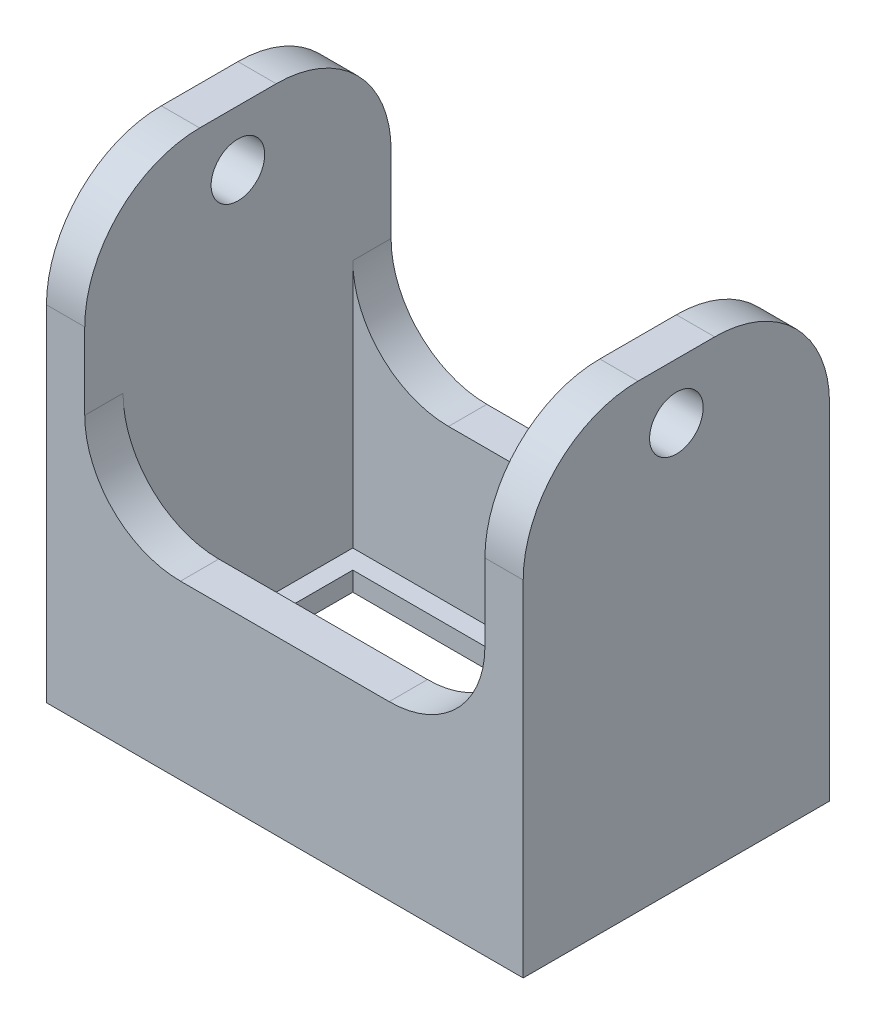
ISO-10303-21;
HEADER;
FILE_DESCRIPTION(('STEP AP214'),'2;1');
FILE_NAME('part.step','',(''),(''),'','','');
FILE_SCHEMA(('AUTOMOTIVE_DESIGN { 1 0 10303 214 1 1 1 1 }'));
ENDSEC;
DATA;
#1=APPLICATION_CONTEXT('core data for automotive mechanical design processes');
#2=APPLICATION_PROTOCOL_DEFINITION('international standard','automotive_design',2000,#1);
#3=PRODUCT_CONTEXT('',#1,'mechanical');
#4=PRODUCT('Part','Part','',(#3));
#5=PRODUCT_RELATED_PRODUCT_CATEGORY('part','',(#4));
#6=PRODUCT_DEFINITION_FORMATION('','',#4);
#7=PRODUCT_DEFINITION_CONTEXT('part definition',#1,'design');
#8=PRODUCT_DEFINITION('design','',#6,#7);
#9=PRODUCT_DEFINITION_SHAPE('','',#8);
#10=(LENGTH_UNIT() NAMED_UNIT(*) SI_UNIT(.MILLI.,.METRE.));
#11=(NAMED_UNIT(*) PLANE_ANGLE_UNIT() SI_UNIT($,.RADIAN.));
#12=(NAMED_UNIT(*) SI_UNIT($,.STERADIAN.) SOLID_ANGLE_UNIT());
#13=UNCERTAINTY_MEASURE_WITH_UNIT(LENGTH_MEASURE(1.E-05),#10,'distance_accuracy_value','');
#14=(GEOMETRIC_REPRESENTATION_CONTEXT(3) GLOBAL_UNCERTAINTY_ASSIGNED_CONTEXT((#13)) GLOBAL_UNIT_ASSIGNED_CONTEXT((#10,
#11,#12)) REPRESENTATION_CONTEXT('',''));
#15=CARTESIAN_POINT('',(0.,0.,0.));
#16=DIRECTION('',(0.,0.,1.));
#17=DIRECTION('',(1.,0.,0.));
#18=AXIS2_PLACEMENT_3D('',#15,#16,#17);
#19=CARTESIAN_POINT('',(0.,9.,0.));
#20=DIRECTION('',(0.,-1.,0.));
#21=DIRECTION('',(0.,0.,-1.));
#22=AXIS2_PLACEMENT_3D('',#19,#20,#21);
#23=PLANE('',#22);
#24=DIRECTION('',(-1.,0.,0.));
#25=VECTOR('',#24,1.);
#26=CARTESIAN_POINT('',(-12.45,9.,-8.));
#27=LINE('',#26,#25);
#28=CARTESIAN_POINT('',(5.45,9.,-8.));
#29=VERTEX_POINT('',#28);
#30=CARTESIAN_POINT('',(-5.45,9.,-8.));
#31=VERTEX_POINT('',#30);
#32=EDGE_CURVE('E217',#29,#31,#27,.T.);
#33=ORIENTED_EDGE('',*,*,#32,.T.);
#34=DIRECTION('',(0.,0.,-1.));
#35=VECTOR('',#34,1.);
#36=CARTESIAN_POINT('',(-5.45,9.,0.));
#37=LINE('',#36,#35);
#38=CARTESIAN_POINT('',(-5.45,9.,-6.));
#39=VERTEX_POINT('',#38);
#40=EDGE_CURVE('E761',#31,#39,#37,.F.);
#41=ORIENTED_EDGE('',*,*,#40,.T.);
#42=DIRECTION('',(-1.,0.,0.));
#43=VECTOR('',#42,1.);
#44=CARTESIAN_POINT('',(10.45,9.,-6.));
#45=LINE('',#44,#43);
#46=CARTESIAN_POINT('',(5.45,9.,-6.));
#47=VERTEX_POINT('',#46);
#48=EDGE_CURVE('E249',#47,#39,#45,.T.);
#49=ORIENTED_EDGE('',*,*,#48,.F.);
#50=DIRECTION('',(0.,0.,1.));
#51=VECTOR('',#50,1.);
#52=CARTESIAN_POINT('',(5.45,9.,0.));
#53=LINE('',#52,#51);
#54=EDGE_CURVE('E253',#47,#29,#53,.F.);
#55=ORIENTED_EDGE('',*,*,#54,.T.);
#56=EDGE_LOOP('',(#33,#41,#49,#55));
#57=FACE_BOUND('',#56,.T.);
#58=ADVANCED_FACE('F35',(#57),#23,.F.);
#59=DIRECTION('',(1.,0.,0.));
#60=VECTOR('',#59,1.);
#61=CARTESIAN_POINT('',(-10.45,9.,6.));
#62=LINE('',#61,#60);
#63=CARTESIAN_POINT('',(-5.45,9.,6.));
#64=VERTEX_POINT('',#63);
#65=CARTESIAN_POINT('',(5.45,9.,6.));
#66=VERTEX_POINT('',#65);
#67=EDGE_CURVE('E233',#64,#66,#62,.T.);
#68=ORIENTED_EDGE('',*,*,#67,.F.);
#69=DIRECTION('',(0.,0.,-1.));
#70=VECTOR('',#69,1.);
#71=CARTESIAN_POINT('',(-5.45,9.,0.));
#72=LINE('',#71,#70);
#73=CARTESIAN_POINT('',(-5.45,9.,8.));
#74=VERTEX_POINT('',#73);
#75=EDGE_CURVE('E247',#64,#74,#72,.F.);
#76=ORIENTED_EDGE('',*,*,#75,.T.);
#77=DIRECTION('',(1.,0.,0.));
#78=VECTOR('',#77,1.);
#79=CARTESIAN_POINT('',(-12.45,9.,8.));
#80=LINE('',#79,#78);
#81=CARTESIAN_POINT('',(5.45,9.,8.));
#82=VERTEX_POINT('',#81);
#83=EDGE_CURVE('E246',#74,#82,#80,.T.);
#84=ORIENTED_EDGE('',*,*,#83,.T.);
#85=DIRECTION('',(0.,0.,1.));
#86=VECTOR('',#85,1.);
#87=CARTESIAN_POINT('',(5.45,9.,0.));
#88=LINE('',#87,#86);
#89=EDGE_CURVE('E275',#82,#66,#88,.F.);
#90=ORIENTED_EDGE('',*,*,#89,.T.);
#91=EDGE_LOOP('',(#68,#76,#84,#90));
#92=FACE_BOUND('',#91,.T.);
#93=ADVANCED_FACE('F364',(#92),#23,.F.);
#94=CARTESIAN_POINT('',(0.,1.,0.));
#95=DIRECTION('',(0.,-1.,0.));
#96=DIRECTION('',(0.,0.,-1.));
#97=AXIS2_PLACEMENT_3D('',#94,#95,#96);
#98=PLANE('',#97);
#99=DIRECTION('',(-1.,0.,0.));
#100=VECTOR('',#99,1.);
#101=CARTESIAN_POINT('',(10.45,1.,-6.));
#102=LINE('',#101,#100);
#103=CARTESIAN_POINT('',(10.45,1.,-6.));
#104=VERTEX_POINT('',#103);
#105=CARTESIAN_POINT('',(-10.45,1.,-6.));
#106=VERTEX_POINT('',#105);
#107=EDGE_CURVE('E222',#104,#106,#102,.T.);
#108=ORIENTED_EDGE('',*,*,#107,.T.);
#109=DIRECTION('',(0.,0.,1.));
#110=VECTOR('',#109,1.);
#111=CARTESIAN_POINT('',(-10.45,1.,-6.));
#112=LINE('',#111,#110);
#113=CARTESIAN_POINT('',(-10.45,1.,6.));
#114=VERTEX_POINT('',#113);
#115=EDGE_CURVE('E209',#106,#114,#112,.T.);
#116=ORIENTED_EDGE('',*,*,#115,.T.);
#117=DIRECTION('',(1.,0.,0.));
#118=VECTOR('',#117,1.);
#119=CARTESIAN_POINT('',(-10.45,1.,6.));
#120=LINE('',#119,#118);
#121=CARTESIAN_POINT('',(10.45,1.,6.));
#122=VERTEX_POINT('',#121);
#123=EDGE_CURVE('E197',#114,#122,#120,.T.);
#124=ORIENTED_EDGE('',*,*,#123,.T.);
#125=DIRECTION('',(0.,0.,-1.));
#126=VECTOR('',#125,1.);
#127=CARTESIAN_POINT('',(10.45,1.,6.));
#128=LINE('',#127,#126);
#129=EDGE_CURVE('E208',#122,#104,#128,.T.);
#130=ORIENTED_EDGE('',*,*,#129,.T.);
#131=EDGE_LOOP('',(#108,#116,#124,#130));
#132=FACE_BOUND('',#131,.T.);
#133=DIRECTION('',(1.,0.,0.));
#134=VECTOR('',#133,1.);
#135=CARTESIAN_POINT('',(-9.45,1.,5.));
#136=LINE('',#135,#134);
#137=CARTESIAN_POINT('',(-9.45,1.,5.));
#138=VERTEX_POINT('',#137);
#139=CARTESIAN_POINT('',(9.45,1.,5.));
#140=VERTEX_POINT('',#139);
#141=EDGE_CURVE('E319',#138,#140,#136,.T.);
#142=ORIENTED_EDGE('',*,*,#141,.F.);
#143=DIRECTION('',(0.,0.,1.));
#144=VECTOR('',#143,1.);
#145=CARTESIAN_POINT('',(-9.45,1.,5.));
#146=LINE('',#145,#144);
#147=CARTESIAN_POINT('',(-9.45,1.,-5.));
#148=VERTEX_POINT('',#147);
#149=EDGE_CURVE('E315',#148,#138,#146,.T.);
#150=ORIENTED_EDGE('',*,*,#149,.F.);
#151=DIRECTION('',(-1.,0.,0.));
#152=VECTOR('',#151,1.);
#153=CARTESIAN_POINT('',(-9.45,1.,-5.));
#154=LINE('',#153,#152);
#155=CARTESIAN_POINT('',(9.45,1.,-5.));
#156=VERTEX_POINT('',#155);
#157=EDGE_CURVE('E329',#156,#148,#154,.T.);
#158=ORIENTED_EDGE('',*,*,#157,.F.);
#159=DIRECTION('',(0.,0.,-1.));
#160=VECTOR('',#159,1.);
#161=CARTESIAN_POINT('',(9.45,1.,5.));
#162=LINE('',#161,#160);
#163=EDGE_CURVE('E332',#140,#156,#162,.T.);
#164=ORIENTED_EDGE('',*,*,#163,.F.);
#165=EDGE_LOOP('',(#142,#150,#158,#164));
#166=FACE_BOUND('',#165,.T.);
#167=ADVANCED_FACE('F219',(#132,#166),#98,.F.);
#168=CARTESIAN_POINT('',(0.,0.,0.));
#169=DIRECTION('',(0.,-1.,0.));
#170=DIRECTION('',(0.,0.,-1.));
#171=AXIS2_PLACEMENT_3D('',#168,#169,#170);
#172=PLANE('',#171);
#173=DIRECTION('',(0.,0.,-1.));
#174=VECTOR('',#173,1.);
#175=CARTESIAN_POINT('',(12.45,0.,8.));
#176=LINE('',#175,#174);
#177=CARTESIAN_POINT('',(12.45,0.,8.));
#178=VERTEX_POINT('',#177);
#179=CARTESIAN_POINT('',(12.45,0.,-8.));
#180=VERTEX_POINT('',#179);
#181=EDGE_CURVE('E302',#178,#180,#176,.T.);
#182=ORIENTED_EDGE('',*,*,#181,.F.);
#183=DIRECTION('',(1.,0.,0.));
#184=VECTOR('',#183,1.);
#185=CARTESIAN_POINT('',(-12.45,0.,8.));
#186=LINE('',#185,#184);
#187=CARTESIAN_POINT('',(-12.45,0.,8.));
#188=VERTEX_POINT('',#187);
#189=EDGE_CURVE('E294',#188,#178,#186,.T.);
#190=ORIENTED_EDGE('',*,*,#189,.F.);
#191=DIRECTION('',(0.,0.,1.));
#192=VECTOR('',#191,1.);
#193=CARTESIAN_POINT('',(-12.45,0.,8.));
#194=LINE('',#193,#192);
#195=CARTESIAN_POINT('',(-12.45,0.,-8.));
#196=VERTEX_POINT('',#195);
#197=EDGE_CURVE('E297',#196,#188,#194,.T.);
#198=ORIENTED_EDGE('',*,*,#197,.F.);
#199=DIRECTION('',(-1.,0.,0.));
#200=VECTOR('',#199,1.);
#201=CARTESIAN_POINT('',(-12.45,0.,-8.));
#202=LINE('',#201,#200);
#203=EDGE_CURVE('E300',#180,#196,#202,.T.);
#204=ORIENTED_EDGE('',*,*,#203,.F.);
#205=EDGE_LOOP('',(#182,#190,#198,#204));
#206=FACE_BOUND('',#205,.T.);
#207=DIRECTION('',(0.,0.,1.));
#208=VECTOR('',#207,1.);
#209=CARTESIAN_POINT('',(-9.45,0.,5.));
#210=LINE('',#209,#208);
#211=CARTESIAN_POINT('',(-9.45,0.,-5.));
#212=VERTEX_POINT('',#211);
#213=CARTESIAN_POINT('',(-9.45,0.,5.));
#214=VERTEX_POINT('',#213);
#215=EDGE_CURVE('E316',#212,#214,#210,.T.);
#216=ORIENTED_EDGE('',*,*,#215,.T.);
#217=DIRECTION('',(1.,0.,0.));
#218=VECTOR('',#217,1.);
#219=CARTESIAN_POINT('',(-9.45,0.,5.));
#220=LINE('',#219,#218);
#221=CARTESIAN_POINT('',(9.45,0.,5.));
#222=VERTEX_POINT('',#221);
#223=EDGE_CURVE('E274',#214,#222,#220,.T.);
#224=ORIENTED_EDGE('',*,*,#223,.T.);
#225=DIRECTION('',(0.,0.,-1.));
#226=VECTOR('',#225,1.);
#227=CARTESIAN_POINT('',(9.45,0.,5.));
#228=LINE('',#227,#226);
#229=CARTESIAN_POINT('',(9.45,0.,-5.));
#230=VERTEX_POINT('',#229);
#231=EDGE_CURVE('E323',#222,#230,#228,.T.);
#232=ORIENTED_EDGE('',*,*,#231,.T.);
#233=DIRECTION('',(-1.,0.,0.));
#234=VECTOR('',#233,1.);
#235=CARTESIAN_POINT('',(-9.45,0.,-5.));
#236=LINE('',#235,#234);
#237=EDGE_CURVE('E320',#230,#212,#236,.T.);
#238=ORIENTED_EDGE('',*,*,#237,.T.);
#239=EDGE_LOOP('',(#216,#224,#232,#238));
#240=FACE_BOUND('',#239,.T.);
#241=ADVANCED_FACE('F349',(#206,#240),#172,.T.);
#242=CARTESIAN_POINT('',(12.45,1.,8.));
#243=DIRECTION('',(-1.,0.,0.));
#244=DIRECTION('',(0.,0.,1.));
#245=AXIS2_PLACEMENT_3D('',#242,#243,#244);
#246=PLANE('',#245);
#247=CARTESIAN_POINT('',(12.45,21.1,0.));
#248=DIRECTION('',(1.,0.,0.));
#249=DIRECTION('',(0.,0.,-1.));
#250=AXIS2_PLACEMENT_3D('',#247,#248,#249);
#251=CIRCLE('',#250,1.4);
#252=CARTESIAN_POINT('',(12.45,21.1,-1.4));
#253=VERTEX_POINT('',#252);
#254=EDGE_CURVE('E410',#253,#253,#251,.T.);
#255=ORIENTED_EDGE('',*,*,#254,.F.);
#256=EDGE_LOOP('',(#255));
#257=FACE_BOUND('',#256,.T.);
#258=DIRECTION('',(0.,-1.,0.));
#259=VECTOR('',#258,1.);
#260=CARTESIAN_POINT('',(12.45,1.,-8.));
#261=LINE('',#260,#259);
#262=CARTESIAN_POINT('',(12.45,18.,-8.));
#263=VERTEX_POINT('',#262);
#264=EDGE_CURVE('E281',#263,#180,#261,.T.);
#265=ORIENTED_EDGE('',*,*,#264,.F.);
#266=CARTESIAN_POINT('',(12.45,18.,-2.));
#267=DIRECTION('',(-1.,0.,0.));
#268=DIRECTION('',(0.,0.,1.));
#269=AXIS2_PLACEMENT_3D('',#266,#267,#268);
#270=CIRCLE('',#269,6.);
#271=CARTESIAN_POINT('',(12.45,24.,-2.));
#272=VERTEX_POINT('',#271);
#273=EDGE_CURVE('E446',#263,#272,#270,.F.);
#274=ORIENTED_EDGE('',*,*,#273,.T.);
#275=DIRECTION('',(0.,0.,-1.));
#276=VECTOR('',#275,1.);
#277=CARTESIAN_POINT('',(12.45,24.,-8.));
#278=LINE('',#277,#276);
#279=CARTESIAN_POINT('',(12.45,24.,2.));
#280=VERTEX_POINT('',#279);
#281=EDGE_CURVE('E420',#280,#272,#278,.T.);
#282=ORIENTED_EDGE('',*,*,#281,.F.);
#283=CARTESIAN_POINT('',(12.45,18.,2.));
#284=DIRECTION('',(-1.,0.,0.));
#285=DIRECTION('',(0.,0.,1.));
#286=AXIS2_PLACEMENT_3D('',#283,#284,#285);
#287=CIRCLE('',#286,6.);
#288=CARTESIAN_POINT('',(12.45,18.,8.));
#289=VERTEX_POINT('',#288);
#290=EDGE_CURVE('E444',#280,#289,#287,.F.);
#291=ORIENTED_EDGE('',*,*,#290,.T.);
#292=DIRECTION('',(0.,-1.,0.));
#293=VECTOR('',#292,1.);
#294=CARTESIAN_POINT('',(12.45,1.,8.));
#295=LINE('',#294,#293);
#296=EDGE_CURVE('E292',#289,#178,#295,.T.);
#297=ORIENTED_EDGE('',*,*,#296,.T.);
#298=ORIENTED_EDGE('',*,*,#181,.T.);
#299=EDGE_LOOP('',(#265,#274,#282,#291,#297,#298));
#300=FACE_BOUND('',#299,.T.);
#301=ADVANCED_FACE('F492',(#257,#300),#246,.F.);
#302=CARTESIAN_POINT('',(-12.45,1.,-8.));
#303=DIRECTION('',(0.,0.,1.));
#304=DIRECTION('',(1.,0.,0.));
#305=AXIS2_PLACEMENT_3D('',#302,#303,#304);
#306=PLANE('',#305);
#307=DIRECTION('',(0.,-1.,0.));
#308=VECTOR('',#307,1.);
#309=CARTESIAN_POINT('',(10.45,24.,-8.));
#310=LINE('',#309,#308);
#311=CARTESIAN_POINT('',(10.45,18.,-8.));
#312=VERTEX_POINT('',#311);
#313=CARTESIAN_POINT('',(10.45,14.,-8.));
#314=VERTEX_POINT('',#313);
#315=EDGE_CURVE('E428',#312,#314,#310,.T.);
#316=ORIENTED_EDGE('',*,*,#315,.F.);
#317=DIRECTION('',(-1.,0.,0.));
#318=VECTOR('',#317,1.);
#319=CARTESIAN_POINT('',(-12.45,18.,-8.));
#320=LINE('',#319,#318);
#321=EDGE_CURVE('E442',#312,#263,#320,.F.);
#322=ORIENTED_EDGE('',*,*,#321,.T.);
#323=ORIENTED_EDGE('',*,*,#264,.T.);
#324=ORIENTED_EDGE('',*,*,#203,.T.);
#325=DIRECTION('',(0.,-1.,0.));
#326=VECTOR('',#325,1.);
#327=CARTESIAN_POINT('',(-12.45,1.,-8.));
#328=LINE('',#327,#326);
#329=CARTESIAN_POINT('',(-12.45,18.,-8.));
#330=VERTEX_POINT('',#329);
#331=EDGE_CURVE('E283',#330,#196,#328,.T.);
#332=ORIENTED_EDGE('',*,*,#331,.F.);
#333=DIRECTION('',(-1.,0.,0.));
#334=VECTOR('',#333,1.);
#335=CARTESIAN_POINT('',(-10.45,18.,-8.));
#336=LINE('',#335,#334);
#337=CARTESIAN_POINT('',(-10.45,18.,-8.));
#338=VERTEX_POINT('',#337);
#339=EDGE_CURVE('E440',#330,#338,#336,.F.);
#340=ORIENTED_EDGE('',*,*,#339,.T.);
#341=DIRECTION('',(0.,-1.,0.));
#342=VECTOR('',#341,1.);
#343=CARTESIAN_POINT('',(-10.45,24.,-8.));
#344=LINE('',#343,#342);
#345=CARTESIAN_POINT('',(-10.45,14.,-8.));
#346=VERTEX_POINT('',#345);
#347=EDGE_CURVE('E225',#338,#346,#344,.T.);
#348=ORIENTED_EDGE('',*,*,#347,.T.);
#349=CARTESIAN_POINT('',(-5.45,14.,-8.));
#350=DIRECTION('',(0.,0.,1.));
#351=DIRECTION('',(1.,0.,0.));
#352=AXIS2_PLACEMENT_3D('',#349,#350,#351);
#353=CIRCLE('',#352,5.);
#354=EDGE_CURVE('E717',#346,#31,#353,.T.);
#355=ORIENTED_EDGE('',*,*,#354,.T.);
#356=ORIENTED_EDGE('',*,*,#32,.F.);
#357=CARTESIAN_POINT('',(5.45,14.,-8.));
#358=DIRECTION('',(0.,0.,1.));
#359=DIRECTION('',(1.,0.,0.));
#360=AXIS2_PLACEMENT_3D('',#357,#358,#359);
#361=CIRCLE('',#360,5.);
#362=EDGE_CURVE('E733',#29,#314,#361,.T.);
#363=ORIENTED_EDGE('',*,*,#362,.T.);
#364=EDGE_LOOP('',(#316,#322,#323,#324,#332,#340,#348,#355,#356,#363));
#365=FACE_BOUND('',#364,.T.);
#366=ADVANCED_FACE('F464',(#365),#306,.F.);
#367=CARTESIAN_POINT('',(-12.45,1.,8.));
#368=DIRECTION('',(1.,0.,0.));
#369=DIRECTION('',(0.,0.,-1.));
#370=AXIS2_PLACEMENT_3D('',#367,#368,#369);
#371=PLANE('',#370);
#372=CARTESIAN_POINT('',(-12.45,21.1,0.));
#373=DIRECTION('',(1.,0.,0.));
#374=DIRECTION('',(0.,0.,-1.));
#375=AXIS2_PLACEMENT_3D('',#372,#373,#374);
#376=CIRCLE('',#375,1.4);
#377=CARTESIAN_POINT('',(-12.45,21.1,-1.4));
#378=VERTEX_POINT('',#377);
#379=EDGE_CURVE('E412',#378,#378,#376,.F.);
#380=ORIENTED_EDGE('',*,*,#379,.F.);
#381=EDGE_LOOP('',(#380));
#382=FACE_BOUND('',#381,.T.);
#383=DIRECTION('',(0.,-1.,0.));
#384=VECTOR('',#383,1.);
#385=CARTESIAN_POINT('',(-12.45,1.,8.));
#386=LINE('',#385,#384);
#387=CARTESIAN_POINT('',(-12.45,18.,8.));
#388=VERTEX_POINT('',#387);
#389=EDGE_CURVE('E288',#388,#188,#386,.T.);
#390=ORIENTED_EDGE('',*,*,#389,.F.);
#391=CARTESIAN_POINT('',(-12.45,18.,2.));
#392=DIRECTION('',(1.,0.,0.));
#393=DIRECTION('',(0.,0.,-1.));
#394=AXIS2_PLACEMENT_3D('',#391,#392,#393);
#395=CIRCLE('',#394,6.);
#396=CARTESIAN_POINT('',(-12.45,24.,2.));
#397=VERTEX_POINT('',#396);
#398=EDGE_CURVE('E11',#388,#397,#395,.F.);
#399=ORIENTED_EDGE('',*,*,#398,.T.);
#400=DIRECTION('',(0.,0.,1.));
#401=VECTOR('',#400,1.);
#402=CARTESIAN_POINT('',(-12.45,24.,-8.));
#403=LINE('',#402,#401);
#404=CARTESIAN_POINT('',(-12.45,24.,-2.));
#405=VERTEX_POINT('',#404);
#406=EDGE_CURVE('E429',#405,#397,#403,.T.);
#407=ORIENTED_EDGE('',*,*,#406,.F.);
#408=CARTESIAN_POINT('',(-12.45,18.,-2.));
#409=DIRECTION('',(1.,0.,0.));
#410=DIRECTION('',(0.,0.,-1.));
#411=AXIS2_PLACEMENT_3D('',#408,#409,#410);
#412=CIRCLE('',#411,6.);
#413=EDGE_CURVE('E43',#405,#330,#412,.F.);
#414=ORIENTED_EDGE('',*,*,#413,.T.);
#415=ORIENTED_EDGE('',*,*,#331,.T.);
#416=ORIENTED_EDGE('',*,*,#197,.T.);
#417=EDGE_LOOP('',(#390,#399,#407,#414,#415,#416));
#418=FACE_BOUND('',#417,.T.);
#419=ADVANCED_FACE('F460',(#382,#418),#371,.F.);
#420=CARTESIAN_POINT('',(-12.45,1.,8.));
#421=DIRECTION('',(0.,0.,-1.));
#422=DIRECTION('',(-1.,0.,0.));
#423=AXIS2_PLACEMENT_3D('',#420,#421,#422);
#424=PLANE('',#423);
#425=ORIENTED_EDGE('',*,*,#296,.F.);
#426=DIRECTION('',(1.,0.,0.));
#427=VECTOR('',#426,1.);
#428=CARTESIAN_POINT('',(-12.45,18.,8.));
#429=LINE('',#428,#427);
#430=CARTESIAN_POINT('',(10.45,18.,8.));
#431=VERTEX_POINT('',#430);
#432=EDGE_CURVE('E450',#289,#431,#429,.F.);
#433=ORIENTED_EDGE('',*,*,#432,.T.);
#434=DIRECTION('',(0.,-1.,0.));
#435=VECTOR('',#434,1.);
#436=CARTESIAN_POINT('',(10.45,24.,8.));
#437=LINE('',#436,#435);
#438=CARTESIAN_POINT('',(10.45,14.,8.));
#439=VERTEX_POINT('',#438);
#440=EDGE_CURVE('E426',#431,#439,#437,.T.);
#441=ORIENTED_EDGE('',*,*,#440,.T.);
#442=CARTESIAN_POINT('',(5.45,14.,8.));
#443=DIRECTION('',(0.,0.,-1.));
#444=DIRECTION('',(-1.,0.,0.));
#445=AXIS2_PLACEMENT_3D('',#442,#443,#444);
#446=CIRCLE('',#445,5.);
#447=EDGE_CURVE('E736',#439,#82,#446,.T.);
#448=ORIENTED_EDGE('',*,*,#447,.T.);
#449=ORIENTED_EDGE('',*,*,#83,.F.);
#450=CARTESIAN_POINT('',(-5.45,14.,8.));
#451=DIRECTION('',(0.,0.,-1.));
#452=DIRECTION('',(-1.,0.,0.));
#453=AXIS2_PLACEMENT_3D('',#450,#451,#452);
#454=CIRCLE('',#453,5.);
#455=CARTESIAN_POINT('',(-10.45,14.,8.));
#456=VERTEX_POINT('',#455);
#457=EDGE_CURVE('E715',#74,#456,#454,.T.);
#458=ORIENTED_EDGE('',*,*,#457,.T.);
#459=DIRECTION('',(0.,-1.,0.));
#460=VECTOR('',#459,1.);
#461=CARTESIAN_POINT('',(-10.45,24.,8.));
#462=LINE('',#461,#460);
#463=CARTESIAN_POINT('',(-10.45,18.,8.));
#464=VERTEX_POINT('',#463);
#465=EDGE_CURVE('E223',#464,#456,#462,.T.);
#466=ORIENTED_EDGE('',*,*,#465,.F.);
#467=DIRECTION('',(1.,0.,0.));
#468=VECTOR('',#467,1.);
#469=CARTESIAN_POINT('',(-12.45,18.,8.));
#470=LINE('',#469,#468);
#471=EDGE_CURVE('E447',#464,#388,#470,.F.);
#472=ORIENTED_EDGE('',*,*,#471,.T.);
#473=ORIENTED_EDGE('',*,*,#389,.T.);
#474=ORIENTED_EDGE('',*,*,#189,.T.);
#475=EDGE_LOOP('',(#425,#433,#441,#448,#449,#458,#466,#472,#473,#474));
#476=FACE_BOUND('',#475,.T.);
#477=ADVANCED_FACE('F499',(#476),#424,.F.);
#478=CARTESIAN_POINT('',(-9.45,1.,5.));
#479=DIRECTION('',(0.,0.,-1.));
#480=DIRECTION('',(-1.,0.,0.));
#481=AXIS2_PLACEMENT_3D('',#478,#479,#480);
#482=PLANE('',#481);
#483=ORIENTED_EDGE('',*,*,#223,.F.);
#484=DIRECTION('',(0.,-1.,0.));
#485=VECTOR('',#484,1.);
#486=CARTESIAN_POINT('',(-9.45,1.,5.));
#487=LINE('',#486,#485);
#488=EDGE_CURVE('E312',#138,#214,#487,.T.);
#489=ORIENTED_EDGE('',*,*,#488,.F.);
#490=ORIENTED_EDGE('',*,*,#141,.T.);
#491=DIRECTION('',(0.,-1.,0.));
#492=VECTOR('',#491,1.);
#493=CARTESIAN_POINT('',(9.45,1.,5.));
#494=LINE('',#493,#492);
#495=EDGE_CURVE('E305',#140,#222,#494,.T.);
#496=ORIENTED_EDGE('',*,*,#495,.T.);
#497=EDGE_LOOP('',(#483,#489,#490,#496));
#498=FACE_BOUND('',#497,.T.);
#499=ADVANCED_FACE('F337',(#498),#482,.T.);
#500=CARTESIAN_POINT('',(9.45,1.,5.));
#501=DIRECTION('',(-1.,0.,0.));
#502=DIRECTION('',(0.,0.,1.));
#503=AXIS2_PLACEMENT_3D('',#500,#501,#502);
#504=PLANE('',#503);
#505=ORIENTED_EDGE('',*,*,#231,.F.);
#506=ORIENTED_EDGE('',*,*,#495,.F.);
#507=ORIENTED_EDGE('',*,*,#163,.T.);
#508=DIRECTION('',(0.,-1.,0.));
#509=VECTOR('',#508,1.);
#510=CARTESIAN_POINT('',(9.45,1.,-5.));
#511=LINE('',#510,#509);
#512=EDGE_CURVE('E308',#156,#230,#511,.T.);
#513=ORIENTED_EDGE('',*,*,#512,.T.);
#514=EDGE_LOOP('',(#505,#506,#507,#513));
#515=FACE_BOUND('',#514,.T.);
#516=ADVANCED_FACE('F341',(#515),#504,.T.);
#517=CARTESIAN_POINT('',(-9.45,1.,-5.));
#518=DIRECTION('',(0.,0.,1.));
#519=DIRECTION('',(1.,0.,0.));
#520=AXIS2_PLACEMENT_3D('',#517,#518,#519);
#521=PLANE('',#520);
#522=ORIENTED_EDGE('',*,*,#237,.F.);
#523=ORIENTED_EDGE('',*,*,#512,.F.);
#524=ORIENTED_EDGE('',*,*,#157,.T.);
#525=DIRECTION('',(0.,-1.,0.));
#526=VECTOR('',#525,1.);
#527=CARTESIAN_POINT('',(-9.45,1.,-5.));
#528=LINE('',#527,#526);
#529=EDGE_CURVE('E310',#148,#212,#528,.T.);
#530=ORIENTED_EDGE('',*,*,#529,.T.);
#531=EDGE_LOOP('',(#522,#523,#524,#530));
#532=FACE_BOUND('',#531,.T.);
#533=ADVANCED_FACE('F346',(#532),#521,.T.);
#534=CARTESIAN_POINT('',(-9.45,1.,5.));
#535=DIRECTION('',(1.,0.,0.));
#536=DIRECTION('',(0.,0.,-1.));
#537=AXIS2_PLACEMENT_3D('',#534,#535,#536);
#538=PLANE('',#537);
#539=ORIENTED_EDGE('',*,*,#215,.F.);
#540=ORIENTED_EDGE('',*,*,#529,.F.);
#541=ORIENTED_EDGE('',*,*,#149,.T.);
#542=ORIENTED_EDGE('',*,*,#488,.T.);
#543=EDGE_LOOP('',(#539,#540,#541,#542));
#544=FACE_BOUND('',#543,.T.);
#545=ADVANCED_FACE('F351',(#544),#538,.T.);
#546=CARTESIAN_POINT('',(-10.45,9.,-6.));
#547=DIRECTION('',(1.,0.,0.));
#548=DIRECTION('',(0.,0.,-1.));
#549=AXIS2_PLACEMENT_3D('',#546,#547,#548);
#550=PLANE('',#549);
#551=CARTESIAN_POINT('',(-10.45,21.1,0.));
#552=DIRECTION('',(1.,0.,0.));
#553=DIRECTION('',(0.,0.,-1.));
#554=AXIS2_PLACEMENT_3D('',#551,#552,#553);
#555=CIRCLE('',#554,1.4);
#556=CARTESIAN_POINT('',(-10.45,21.1,-1.4));
#557=VERTEX_POINT('',#556);
#558=EDGE_CURVE('E417',#557,#557,#555,.T.);
#559=ORIENTED_EDGE('',*,*,#558,.F.);
#560=EDGE_LOOP('',(#559));
#561=FACE_BOUND('',#560,.T.);
#562=DIRECTION('',(0.,0.,-1.));
#563=VECTOR('',#562,1.);
#564=CARTESIAN_POINT('',(-10.45,24.,-8.));
#565=LINE('',#564,#563);
#566=CARTESIAN_POINT('',(-10.45,24.,2.));
#567=VERTEX_POINT('',#566);
#568=CARTESIAN_POINT('',(-10.45,24.,-2.));
#569=VERTEX_POINT('',#568);
#570=EDGE_CURVE('E228',#567,#569,#565,.T.);
#571=ORIENTED_EDGE('',*,*,#570,.F.);
#572=CARTESIAN_POINT('',(-10.45,18.,2.));
#573=DIRECTION('',(1.,0.,0.));
#574=DIRECTION('',(0.,0.,-1.));
#575=AXIS2_PLACEMENT_3D('',#572,#573,#574);
#576=CIRCLE('',#575,6.);
#577=EDGE_CURVE('E58',#567,#464,#576,.T.);
#578=ORIENTED_EDGE('',*,*,#577,.T.);
#579=ORIENTED_EDGE('',*,*,#465,.T.);
#580=DIRECTION('',(0.,0.,-1.));
#581=VECTOR('',#580,1.);
#582=CARTESIAN_POINT('',(-10.45,14.,-6.));
#583=LINE('',#582,#581);
#584=CARTESIAN_POINT('',(-10.45,14.,6.));
#585=VERTEX_POINT('',#584);
#586=EDGE_CURVE('E216',#456,#585,#583,.T.);
#587=ORIENTED_EDGE('',*,*,#586,.T.);
#588=DIRECTION('',(0.,-1.,0.));
#589=VECTOR('',#588,1.);
#590=CARTESIAN_POINT('',(-10.45,9.,6.));
#591=LINE('',#590,#589);
#592=EDGE_CURVE('E200',#585,#114,#591,.T.);
#593=ORIENTED_EDGE('',*,*,#592,.T.);
#594=ORIENTED_EDGE('',*,*,#115,.F.);
#595=DIRECTION('',(0.,-1.,0.));
#596=VECTOR('',#595,1.);
#597=CARTESIAN_POINT('',(-10.45,9.,-6.));
#598=LINE('',#597,#596);
#599=CARTESIAN_POINT('',(-10.45,14.,-6.));
#600=VERTEX_POINT('',#599);
#601=EDGE_CURVE('E236',#600,#106,#598,.T.);
#602=ORIENTED_EDGE('',*,*,#601,.F.);
#603=DIRECTION('',(0.,0.,-1.));
#604=VECTOR('',#603,1.);
#605=CARTESIAN_POINT('',(-10.45,14.,-6.));
#606=LINE('',#605,#604);
#607=EDGE_CURVE('E279',#600,#346,#606,.T.);
#608=ORIENTED_EDGE('',*,*,#607,.T.);
#609=ORIENTED_EDGE('',*,*,#347,.F.);
#610=CARTESIAN_POINT('',(-10.45,18.,-2.));
#611=DIRECTION('',(1.,0.,0.));
#612=DIRECTION('',(0.,0.,-1.));
#613=AXIS2_PLACEMENT_3D('',#610,#611,#612);
#614=CIRCLE('',#613,6.);
#615=EDGE_CURVE('E50',#338,#569,#614,.T.);
#616=ORIENTED_EDGE('',*,*,#615,.T.);
#617=EDGE_LOOP('',(#571,#578,#579,#587,#593,#594,#602,#608,#609,#616));
#618=FACE_BOUND('',#617,.T.);
#619=ADVANCED_FACE('F213',(#561,#618),#550,.T.);
#620=CARTESIAN_POINT('',(-10.45,9.,6.));
#621=DIRECTION('',(0.,0.,-1.));
#622=DIRECTION('',(-1.,0.,0.));
#623=AXIS2_PLACEMENT_3D('',#620,#621,#622);
#624=PLANE('',#623);
#625=ORIENTED_EDGE('',*,*,#123,.F.);
#626=ORIENTED_EDGE('',*,*,#592,.F.);
#627=CARTESIAN_POINT('',(-5.45,14.,6.));
#628=DIRECTION('',(0.,0.,-1.));
#629=DIRECTION('',(-1.,0.,0.));
#630=AXIS2_PLACEMENT_3D('',#627,#628,#629);
#631=CIRCLE('',#630,5.);
#632=EDGE_CURVE('E718',#585,#64,#631,.F.);
#633=ORIENTED_EDGE('',*,*,#632,.T.);
#634=ORIENTED_EDGE('',*,*,#67,.T.);
#635=CARTESIAN_POINT('',(5.45,14.,6.));
#636=DIRECTION('',(0.,0.,-1.));
#637=DIRECTION('',(-1.,0.,0.));
#638=AXIS2_PLACEMENT_3D('',#635,#636,#637);
#639=CIRCLE('',#638,5.);
#640=CARTESIAN_POINT('',(10.45,14.,6.));
#641=VERTEX_POINT('',#640);
#642=EDGE_CURVE('E738',#66,#641,#639,.F.);
#643=ORIENTED_EDGE('',*,*,#642,.T.);
#644=DIRECTION('',(0.,-1.,0.));
#645=VECTOR('',#644,1.);
#646=CARTESIAN_POINT('',(10.45,9.,6.));
#647=LINE('',#646,#645);
#648=EDGE_CURVE('E203',#641,#122,#647,.T.);
#649=ORIENTED_EDGE('',*,*,#648,.T.);
#650=EDGE_LOOP('',(#625,#626,#633,#634,#643,#649));
#651=FACE_BOUND('',#650,.T.);
#652=ADVANCED_FACE('F199',(#651),#624,.T.);
#653=CARTESIAN_POINT('',(10.45,9.,6.));
#654=DIRECTION('',(-1.,0.,0.));
#655=DIRECTION('',(0.,0.,1.));
#656=AXIS2_PLACEMENT_3D('',#653,#654,#655);
#657=PLANE('',#656);
#658=CARTESIAN_POINT('',(10.45,21.1,0.));
#659=DIRECTION('',(-1.,0.,0.));
#660=DIRECTION('',(0.,0.,1.));
#661=AXIS2_PLACEMENT_3D('',#658,#659,#660);
#662=CIRCLE('',#661,1.4);
#663=CARTESIAN_POINT('',(10.45,21.1,1.4));
#664=VERTEX_POINT('',#663);
#665=EDGE_CURVE('E407',#664,#664,#662,.T.);
#666=ORIENTED_EDGE('',*,*,#665,.F.);
#667=EDGE_LOOP('',(#666));
#668=FACE_BOUND('',#667,.T.);
#669=DIRECTION('',(0.,0.,1.));
#670=VECTOR('',#669,1.);
#671=CARTESIAN_POINT('',(10.45,24.,-8.));
#672=LINE('',#671,#670);
#673=CARTESIAN_POINT('',(10.45,24.,-2.));
#674=VERTEX_POINT('',#673);
#675=CARTESIAN_POINT('',(10.45,24.,2.));
#676=VERTEX_POINT('',#675);
#677=EDGE_CURVE('E423',#674,#676,#672,.T.);
#678=ORIENTED_EDGE('',*,*,#677,.F.);
#679=CARTESIAN_POINT('',(10.45,18.,-2.));
#680=DIRECTION('',(-1.,0.,0.));
#681=DIRECTION('',(0.,0.,1.));
#682=AXIS2_PLACEMENT_3D('',#679,#680,#681);
#683=CIRCLE('',#682,6.);
#684=EDGE_CURVE('E438',#674,#312,#683,.T.);
#685=ORIENTED_EDGE('',*,*,#684,.T.);
#686=ORIENTED_EDGE('',*,*,#315,.T.);
#687=DIRECTION('',(0.,0.,1.));
#688=VECTOR('',#687,1.);
#689=CARTESIAN_POINT('',(10.45,14.,6.));
#690=LINE('',#689,#688);
#691=CARTESIAN_POINT('',(10.45,14.,-6.));
#692=VERTEX_POINT('',#691);
#693=EDGE_CURVE('E720',#314,#692,#690,.T.);
#694=ORIENTED_EDGE('',*,*,#693,.T.);
#695=DIRECTION('',(0.,-1.,0.));
#696=VECTOR('',#695,1.);
#697=CARTESIAN_POINT('',(10.45,9.,-6.));
#698=LINE('',#697,#696);
#699=EDGE_CURVE('E234',#692,#104,#698,.T.);
#700=ORIENTED_EDGE('',*,*,#699,.T.);
#701=ORIENTED_EDGE('',*,*,#129,.F.);
#702=ORIENTED_EDGE('',*,*,#648,.F.);
#703=DIRECTION('',(0.,0.,1.));
#704=VECTOR('',#703,1.);
#705=CARTESIAN_POINT('',(10.45,14.,6.));
#706=LINE('',#705,#704);
#707=EDGE_CURVE('E723',#641,#439,#706,.T.);
#708=ORIENTED_EDGE('',*,*,#707,.T.);
#709=ORIENTED_EDGE('',*,*,#440,.F.);
#710=CARTESIAN_POINT('',(10.45,18.,2.));
#711=DIRECTION('',(-1.,0.,0.));
#712=DIRECTION('',(0.,0.,1.));
#713=AXIS2_PLACEMENT_3D('',#710,#711,#712);
#714=CIRCLE('',#713,6.);
#715=EDGE_CURVE('E746',#431,#676,#714,.T.);
#716=ORIENTED_EDGE('',*,*,#715,.T.);
#717=EDGE_LOOP('',(#678,#685,#686,#694,#700,#701,#702,#708,#709,#716));
#718=FACE_BOUND('',#717,.T.);
#719=ADVANCED_FACE('F373',(#668,#718),#657,.T.);
#720=CARTESIAN_POINT('',(10.45,9.,-6.));
#721=DIRECTION('',(0.,0.,1.));
#722=DIRECTION('',(1.,0.,0.));
#723=AXIS2_PLACEMENT_3D('',#720,#721,#722);
#724=PLANE('',#723);
#725=ORIENTED_EDGE('',*,*,#107,.F.);
#726=ORIENTED_EDGE('',*,*,#699,.F.);
#727=CARTESIAN_POINT('',(5.45,14.,-6.));
#728=DIRECTION('',(0.,0.,1.));
#729=DIRECTION('',(1.,0.,0.));
#730=AXIS2_PLACEMENT_3D('',#727,#728,#729);
#731=CIRCLE('',#730,5.);
#732=EDGE_CURVE('E731',#692,#47,#731,.F.);
#733=ORIENTED_EDGE('',*,*,#732,.T.);
#734=ORIENTED_EDGE('',*,*,#48,.T.);
#735=CARTESIAN_POINT('',(-5.45,14.,-6.));
#736=DIRECTION('',(0.,0.,1.));
#737=DIRECTION('',(1.,0.,0.));
#738=AXIS2_PLACEMENT_3D('',#735,#736,#737);
#739=CIRCLE('',#738,5.);
#740=EDGE_CURVE('E728',#39,#600,#739,.F.);
#741=ORIENTED_EDGE('',*,*,#740,.T.);
#742=ORIENTED_EDGE('',*,*,#601,.T.);
#743=EDGE_LOOP('',(#725,#726,#733,#734,#741,#742));
#744=FACE_BOUND('',#743,.T.);
#745=ADVANCED_FACE('F376',(#744),#724,.T.);
#746=CARTESIAN_POINT('',(0.,24.,0.));
#747=DIRECTION('',(0.,1.,0.));
#748=DIRECTION('',(0.,0.,1.));
#749=AXIS2_PLACEMENT_3D('',#746,#747,#748);
#750=PLANE('',#749);
#751=ORIENTED_EDGE('',*,*,#406,.T.);
#752=DIRECTION('',(1.,0.,0.));
#753=VECTOR('',#752,1.);
#754=CARTESIAN_POINT('',(-10.45,24.,2.));
#755=LINE('',#754,#753);
#756=EDGE_CURVE('E454',#397,#567,#755,.T.);
#757=ORIENTED_EDGE('',*,*,#756,.T.);
#758=ORIENTED_EDGE('',*,*,#570,.T.);
#759=DIRECTION('',(-1.,0.,0.));
#760=VECTOR('',#759,1.);
#761=CARTESIAN_POINT('',(-12.45,24.,-2.));
#762=LINE('',#761,#760);
#763=EDGE_CURVE('E452',#569,#405,#762,.T.);
#764=ORIENTED_EDGE('',*,*,#763,.T.);
#765=EDGE_LOOP('',(#751,#757,#758,#764));
#766=FACE_BOUND('',#765,.T.);
#767=ADVANCED_FACE('F380',(#766),#750,.T.);
#768=CARTESIAN_POINT('',(0.,24.,0.));
#769=DIRECTION('',(0.,-1.,0.));
#770=DIRECTION('',(0.,0.,-1.));
#771=AXIS2_PLACEMENT_3D('',#768,#769,#770);
#772=PLANE('',#771);
#773=ORIENTED_EDGE('',*,*,#281,.T.);
#774=DIRECTION('',(-1.,0.,0.));
#775=VECTOR('',#774,1.);
#776=CARTESIAN_POINT('',(0.,24.,-2.));
#777=LINE('',#776,#775);
#778=EDGE_CURVE('E744',#272,#674,#777,.T.);
#779=ORIENTED_EDGE('',*,*,#778,.T.);
#780=ORIENTED_EDGE('',*,*,#677,.T.);
#781=DIRECTION('',(1.,0.,0.));
#782=VECTOR('',#781,1.);
#783=CARTESIAN_POINT('',(0.,24.,2.));
#784=LINE('',#783,#782);
#785=EDGE_CURVE('E740',#676,#280,#784,.T.);
#786=ORIENTED_EDGE('',*,*,#785,.T.);
#787=EDGE_LOOP('',(#773,#779,#780,#786));
#788=FACE_BOUND('',#787,.T.);
#789=ADVANCED_FACE('F384',(#788),#772,.F.);
#790=CARTESIAN_POINT('',(-5.45,14.,-6.));
#791=DIRECTION('',(0.,0.,-1.));
#792=DIRECTION('',(-1.,0.,0.));
#793=AXIS2_PLACEMENT_3D('',#790,#791,#792);
#794=CYLINDRICAL_SURFACE('',#793,5.);
#795=ORIENTED_EDGE('',*,*,#457,.F.);
#796=ORIENTED_EDGE('',*,*,#75,.F.);
#797=ORIENTED_EDGE('',*,*,#632,.F.);
#798=ORIENTED_EDGE('',*,*,#586,.F.);
#799=EDGE_LOOP('',(#795,#796,#797,#798));
#800=FACE_BOUND('',#799,.T.);
#801=ADVANCED_FACE('F388',(#800),#794,.F.);
#802=CARTESIAN_POINT('',(-5.45,14.,-6.));
#803=DIRECTION('',(0.,0.,-1.));
#804=DIRECTION('',(-1.,0.,0.));
#805=AXIS2_PLACEMENT_3D('',#802,#803,#804);
#806=CYLINDRICAL_SURFACE('',#805,5.);
#807=ORIENTED_EDGE('',*,*,#740,.F.);
#808=ORIENTED_EDGE('',*,*,#40,.F.);
#809=ORIENTED_EDGE('',*,*,#354,.F.);
#810=ORIENTED_EDGE('',*,*,#607,.F.);
#811=EDGE_LOOP('',(#807,#808,#809,#810));
#812=FACE_BOUND('',#811,.T.);
#813=ADVANCED_FACE('F484',(#812),#806,.F.);
#814=CARTESIAN_POINT('',(5.45,14.,6.));
#815=DIRECTION('',(0.,0.,1.));
#816=DIRECTION('',(1.,0.,0.));
#817=AXIS2_PLACEMENT_3D('',#814,#815,#816);
#818=CYLINDRICAL_SURFACE('',#817,5.);
#819=ORIENTED_EDGE('',*,*,#362,.F.);
#820=ORIENTED_EDGE('',*,*,#54,.F.);
#821=ORIENTED_EDGE('',*,*,#732,.F.);
#822=ORIENTED_EDGE('',*,*,#693,.F.);
#823=EDGE_LOOP('',(#819,#820,#821,#822));
#824=FACE_BOUND('',#823,.T.);
#825=ADVANCED_FACE('F401',(#824),#818,.F.);
#826=CARTESIAN_POINT('',(5.45,14.,6.));
#827=DIRECTION('',(0.,0.,1.));
#828=DIRECTION('',(1.,0.,0.));
#829=AXIS2_PLACEMENT_3D('',#826,#827,#828);
#830=CYLINDRICAL_SURFACE('',#829,5.);
#831=ORIENTED_EDGE('',*,*,#642,.F.);
#832=ORIENTED_EDGE('',*,*,#89,.F.);
#833=ORIENTED_EDGE('',*,*,#447,.F.);
#834=ORIENTED_EDGE('',*,*,#707,.F.);
#835=EDGE_LOOP('',(#831,#832,#833,#834));
#836=FACE_BOUND('',#835,.T.);
#837=ADVANCED_FACE('F393',(#836),#830,.F.);
#838=CARTESIAN_POINT('',(-16.4097979746447,21.1,0.));
#839=DIRECTION('',(1.,0.,0.));
#840=DIRECTION('',(0.,0.,-1.));
#841=AXIS2_PLACEMENT_3D('',#838,#839,#840);
#842=CYLINDRICAL_SURFACE('',#841,1.4);
#843=ORIENTED_EDGE('',*,*,#665,.T.);
#844=EDGE_LOOP('',(#843));
#845=FACE_BOUND('',#844,.T.);
#846=ORIENTED_EDGE('',*,*,#254,.T.);
#847=EDGE_LOOP('',(#846));
#848=FACE_BOUND('',#847,.T.);
#849=ADVANCED_FACE('F390',(#845,#848),#842,.F.);
#850=ORIENTED_EDGE('',*,*,#558,.T.);
#851=EDGE_LOOP('',(#850));
#852=FACE_BOUND('',#851,.T.);
#853=ORIENTED_EDGE('',*,*,#379,.T.);
#854=EDGE_LOOP('',(#853));
#855=FACE_BOUND('',#854,.T.);
#856=ADVANCED_FACE('F392',(#852,#855),#842,.F.);
#857=CARTESIAN_POINT('',(0.,18.,-2.));
#858=DIRECTION('',(-1.,0.,0.));
#859=DIRECTION('',(0.,0.,1.));
#860=AXIS2_PLACEMENT_3D('',#857,#858,#859);
#861=CYLINDRICAL_SURFACE('',#860,6.);
#862=ORIENTED_EDGE('',*,*,#273,.F.);
#863=ORIENTED_EDGE('',*,*,#321,.F.);
#864=ORIENTED_EDGE('',*,*,#684,.F.);
#865=ORIENTED_EDGE('',*,*,#778,.F.);
#866=EDGE_LOOP('',(#862,#863,#864,#865));
#867=FACE_BOUND('',#866,.T.);
#868=ADVANCED_FACE('F399',(#867),#861,.T.);
#869=CARTESIAN_POINT('',(0.,18.,2.));
#870=DIRECTION('',(1.,0.,0.));
#871=DIRECTION('',(0.,0.,-1.));
#872=AXIS2_PLACEMENT_3D('',#869,#870,#871);
#873=CYLINDRICAL_SURFACE('',#872,6.);
#874=ORIENTED_EDGE('',*,*,#715,.F.);
#875=ORIENTED_EDGE('',*,*,#432,.F.);
#876=ORIENTED_EDGE('',*,*,#290,.F.);
#877=ORIENTED_EDGE('',*,*,#785,.F.);
#878=EDGE_LOOP('',(#874,#875,#876,#877));
#879=FACE_BOUND('',#878,.T.);
#880=ADVANCED_FACE('F471',(#879),#873,.T.);
#881=CARTESIAN_POINT('',(0.,18.,2.));
#882=DIRECTION('',(-1.,0.,0.));
#883=DIRECTION('',(0.,0.,1.));
#884=AXIS2_PLACEMENT_3D('',#881,#882,#883);
#885=CYLINDRICAL_SURFACE('',#884,6.);
#886=ORIENTED_EDGE('',*,*,#398,.F.);
#887=ORIENTED_EDGE('',*,*,#471,.F.);
#888=ORIENTED_EDGE('',*,*,#577,.F.);
#889=ORIENTED_EDGE('',*,*,#756,.F.);
#890=EDGE_LOOP('',(#886,#887,#888,#889));
#891=FACE_BOUND('',#890,.T.);
#892=ADVANCED_FACE('F467',(#891),#885,.T.);
#893=CARTESIAN_POINT('',(0.,18.,-2.));
#894=DIRECTION('',(1.,0.,0.));
#895=DIRECTION('',(0.,0.,-1.));
#896=AXIS2_PLACEMENT_3D('',#893,#894,#895);
#897=CYLINDRICAL_SURFACE('',#896,6.);
#898=ORIENTED_EDGE('',*,*,#615,.F.);
#899=ORIENTED_EDGE('',*,*,#339,.F.);
#900=ORIENTED_EDGE('',*,*,#413,.F.);
#901=ORIENTED_EDGE('',*,*,#763,.F.);
#902=EDGE_LOOP('',(#898,#899,#900,#901));
#903=FACE_BOUND('',#902,.T.);
#904=ADVANCED_FACE('F37',(#903),#897,.T.);
#905=CLOSED_SHELL('',(#58,#93,#167,#241,#301,#366,#419,#477,#499,#516,#533,#545,#619,#652,#719,
#745,#767,#789,#801,#813,#825,#837,#849,#856,#868,#880,#892,#904));
#906=MANIFOLD_SOLID_BREP('B2',#905);
#907=ADVANCED_BREP_SHAPE_REPRESENTATION('',(#18,#906),#14);
#908=SHAPE_DEFINITION_REPRESENTATION(#9,#907);
ENDSEC;
END-ISO-10303-21;
